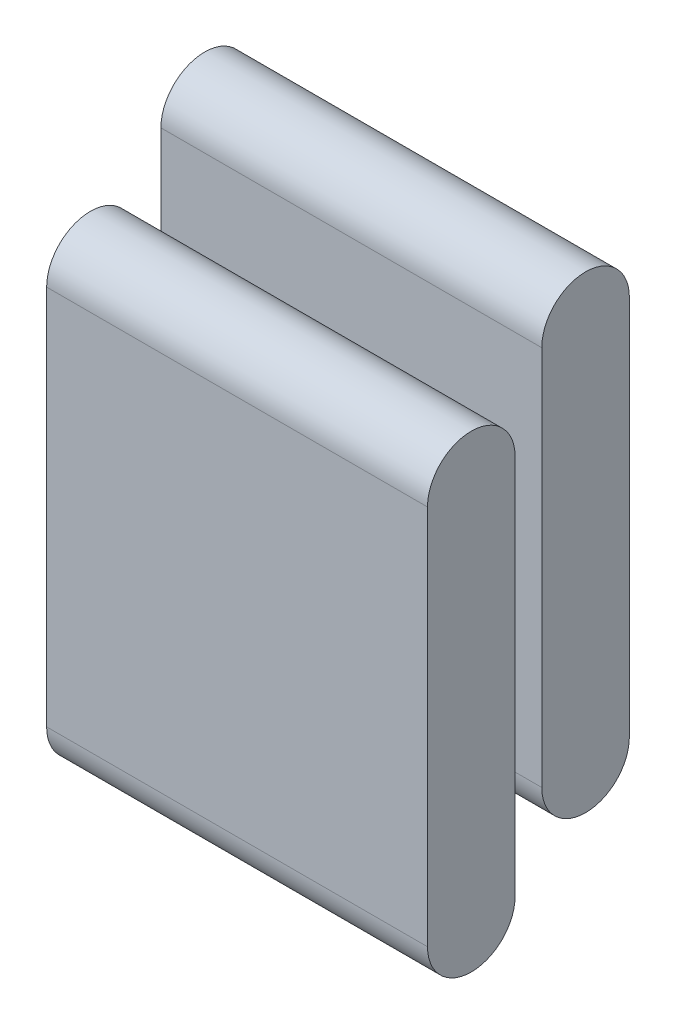
ISO-10303-21;
HEADER;
FILE_DESCRIPTION(('STEP AP214'),'2;1');
FILE_NAME('part.step','',(''),(''),'','','');
FILE_SCHEMA(('AUTOMOTIVE_DESIGN { 1 0 10303 214 1 1 1 1 }'));
ENDSEC;
DATA;
#1=APPLICATION_CONTEXT('core data for automotive mechanical design processes');
#2=APPLICATION_PROTOCOL_DEFINITION('international standard','automotive_design',2000,#1);
#3=PRODUCT_CONTEXT('',#1,'mechanical');
#4=PRODUCT('Part','Part','',(#3));
#5=PRODUCT_RELATED_PRODUCT_CATEGORY('part','',(#4));
#6=PRODUCT_DEFINITION_FORMATION('','',#4);
#7=PRODUCT_DEFINITION_CONTEXT('part definition',#1,'design');
#8=PRODUCT_DEFINITION('design','',#6,#7);
#9=PRODUCT_DEFINITION_SHAPE('','',#8);
#10=(LENGTH_UNIT() NAMED_UNIT(*) SI_UNIT(.MILLI.,.METRE.));
#11=(NAMED_UNIT(*) PLANE_ANGLE_UNIT() SI_UNIT($,.RADIAN.));
#12=(NAMED_UNIT(*) SI_UNIT($,.STERADIAN.) SOLID_ANGLE_UNIT());
#13=UNCERTAINTY_MEASURE_WITH_UNIT(LENGTH_MEASURE(1.E-05),#10,'distance_accuracy_value','');
#14=(GEOMETRIC_REPRESENTATION_CONTEXT(3) GLOBAL_UNCERTAINTY_ASSIGNED_CONTEXT((#13)) GLOBAL_UNIT_ASSIGNED_CONTEXT((#10,
#11,#12)) REPRESENTATION_CONTEXT('',''));
#15=CARTESIAN_POINT('',(0.,0.,0.));
#16=DIRECTION('',(0.,0.,1.));
#17=DIRECTION('',(1.,0.,0.));
#18=AXIS2_PLACEMENT_3D('',#15,#16,#17);
#19=CARTESIAN_POINT('',(10.,14.6986841535707,13.));
#20=DIRECTION('',(-1.,0.,0.));
#21=DIRECTION('',(0.,0.,1.));
#22=AXIS2_PLACEMENT_3D('',#19,#20,#21);
#23=CYLINDRICAL_SURFACE('',#22,1.15);
#24=CARTESIAN_POINT('',(0.,14.6986841535707,13.));
#25=DIRECTION('',(1.,0.,0.));
#26=DIRECTION('',(0.,0.,-1.));
#27=AXIS2_PLACEMENT_3D('',#24,#25,#26);
#28=CIRCLE('',#27,1.15);
#29=CARTESIAN_POINT('',(0.,14.6986841535707,11.85));
#30=VERTEX_POINT('',#29);
#31=CARTESIAN_POINT('',(0.,14.6986841535707,14.15));
#32=VERTEX_POINT('',#31);
#33=EDGE_CURVE('E12',#30,#32,#28,.T.);
#34=ORIENTED_EDGE('',*,*,#33,.T.);
#35=DIRECTION('',(-1.,0.,0.));
#36=VECTOR('',#35,1.);
#37=CARTESIAN_POINT('',(10.,14.6986841535707,14.15));
#38=LINE('',#37,#36);
#39=CARTESIAN_POINT('',(10.,14.6986841535707,14.15));
#40=VERTEX_POINT('',#39);
#41=EDGE_CURVE('E118',#40,#32,#38,.T.);
#42=ORIENTED_EDGE('',*,*,#41,.F.);
#43=CARTESIAN_POINT('',(10.,14.6986841535707,13.));
#44=DIRECTION('',(1.,0.,0.));
#45=DIRECTION('',(0.,0.,-1.));
#46=AXIS2_PLACEMENT_3D('',#43,#44,#45);
#47=CIRCLE('',#46,1.15);
#48=CARTESIAN_POINT('',(10.,14.6986841535707,11.85));
#49=VERTEX_POINT('',#48);
#50=EDGE_CURVE('E51',#49,#40,#47,.T.);
#51=ORIENTED_EDGE('',*,*,#50,.F.);
#52=DIRECTION('',(-1.,0.,0.));
#53=VECTOR('',#52,1.);
#54=CARTESIAN_POINT('',(10.,14.6986841535707,11.85));
#55=LINE('',#54,#53);
#56=EDGE_CURVE('E106',#49,#30,#55,.T.);
#57=ORIENTED_EDGE('',*,*,#56,.T.);
#58=EDGE_LOOP('',(#34,#42,#51,#57));
#59=FACE_BOUND('',#58,.T.);
#60=ADVANCED_FACE('F47',(#59),#23,.T.);
#61=CARTESIAN_POINT('',(10.,14.6986841535707,14.15));
#62=DIRECTION('',(0.,0.,-1.));
#63=DIRECTION('',(0.,1.,0.));
#64=AXIS2_PLACEMENT_3D('',#61,#62,#63);
#65=PLANE('',#64);
#66=DIRECTION('',(0.,-1.,0.));
#67=VECTOR('',#66,1.);
#68=CARTESIAN_POINT('',(0.,14.6986841535707,14.15));
#69=LINE('',#68,#67);
#70=CARTESIAN_POINT('',(0.,4.6986841535707,14.15));
#71=VERTEX_POINT('',#70);
#72=EDGE_CURVE('E57',#32,#71,#69,.T.);
#73=ORIENTED_EDGE('',*,*,#72,.T.);
#74=DIRECTION('',(-1.,0.,0.));
#75=VECTOR('',#74,1.);
#76=CARTESIAN_POINT('',(10.,4.6986841535707,14.15));
#77=LINE('',#76,#75);
#78=CARTESIAN_POINT('',(10.,4.6986841535707,14.15));
#79=VERTEX_POINT('',#78);
#80=EDGE_CURVE('E102',#79,#71,#77,.T.);
#81=ORIENTED_EDGE('',*,*,#80,.F.);
#82=DIRECTION('',(0.,-1.,0.));
#83=VECTOR('',#82,1.);
#84=CARTESIAN_POINT('',(10.,14.6986841535707,14.15));
#85=LINE('',#84,#83);
#86=EDGE_CURVE('E81',#40,#79,#85,.T.);
#87=ORIENTED_EDGE('',*,*,#86,.F.);
#88=ORIENTED_EDGE('',*,*,#41,.T.);
#89=EDGE_LOOP('',(#73,#81,#87,#88));
#90=FACE_BOUND('',#89,.T.);
#91=ADVANCED_FACE('F121',(#90),#65,.F.);
#92=CARTESIAN_POINT('',(10.,4.6986841535707,13.));
#93=DIRECTION('',(-1.,0.,0.));
#94=DIRECTION('',(0.,0.,1.));
#95=AXIS2_PLACEMENT_3D('',#92,#93,#94);
#96=CYLINDRICAL_SURFACE('',#95,1.15);
#97=CARTESIAN_POINT('',(0.,4.6986841535707,13.));
#98=DIRECTION('',(1.,0.,0.));
#99=DIRECTION('',(0.,0.,-1.));
#100=AXIS2_PLACEMENT_3D('',#97,#98,#99);
#101=CIRCLE('',#100,1.15);
#102=CARTESIAN_POINT('',(0.,4.6986841535707,11.85));
#103=VERTEX_POINT('',#102);
#104=EDGE_CURVE('E97',#71,#103,#101,.T.);
#105=ORIENTED_EDGE('',*,*,#104,.T.);
#106=DIRECTION('',(-1.,0.,0.));
#107=VECTOR('',#106,1.);
#108=CARTESIAN_POINT('',(10.,4.6986841535707,11.85));
#109=LINE('',#108,#107);
#110=CARTESIAN_POINT('',(10.,4.6986841535707,11.85));
#111=VERTEX_POINT('',#110);
#112=EDGE_CURVE('E100',#111,#103,#109,.T.);
#113=ORIENTED_EDGE('',*,*,#112,.F.);
#114=CARTESIAN_POINT('',(10.,4.6986841535707,13.));
#115=DIRECTION('',(1.,0.,0.));
#116=DIRECTION('',(0.,0.,-1.));
#117=AXIS2_PLACEMENT_3D('',#114,#115,#116);
#118=CIRCLE('',#117,1.15);
#119=EDGE_CURVE('E114',#79,#111,#118,.T.);
#120=ORIENTED_EDGE('',*,*,#119,.F.);
#121=ORIENTED_EDGE('',*,*,#80,.T.);
#122=EDGE_LOOP('',(#105,#113,#120,#121));
#123=FACE_BOUND('',#122,.T.);
#124=ADVANCED_FACE('F98',(#123),#96,.T.);
#125=CARTESIAN_POINT('',(10.,14.6986841535707,11.85));
#126=DIRECTION('',(0.,0.,1.));
#127=DIRECTION('',(0.,-1.,0.));
#128=AXIS2_PLACEMENT_3D('',#125,#126,#127);
#129=PLANE('',#128);
#130=DIRECTION('',(0.,1.,0.));
#131=VECTOR('',#130,1.);
#132=CARTESIAN_POINT('',(0.,14.6986841535707,11.85));
#133=LINE('',#132,#131);
#134=EDGE_CURVE('E91',#103,#30,#133,.T.);
#135=ORIENTED_EDGE('',*,*,#134,.T.);
#136=ORIENTED_EDGE('',*,*,#56,.F.);
#137=DIRECTION('',(0.,1.,0.));
#138=VECTOR('',#137,1.);
#139=CARTESIAN_POINT('',(10.,14.6986841535707,11.85));
#140=LINE('',#139,#138);
#141=EDGE_CURVE('E105',#111,#49,#140,.T.);
#142=ORIENTED_EDGE('',*,*,#141,.F.);
#143=ORIENTED_EDGE('',*,*,#112,.T.);
#144=EDGE_LOOP('',(#135,#136,#142,#143));
#145=FACE_BOUND('',#144,.T.);
#146=ADVANCED_FACE('F104',(#145),#129,.F.);
#147=CARTESIAN_POINT('',(10.,14.6986841535707,13.));
#148=DIRECTION('',(1.,0.,0.));
#149=DIRECTION('',(0.,0.,-1.));
#150=AXIS2_PLACEMENT_3D('',#147,#148,#149);
#151=PLANE('',#150);
#152=ORIENTED_EDGE('',*,*,#50,.T.);
#153=ORIENTED_EDGE('',*,*,#86,.T.);
#154=ORIENTED_EDGE('',*,*,#119,.T.);
#155=ORIENTED_EDGE('',*,*,#141,.T.);
#156=EDGE_LOOP('',(#152,#153,#154,#155));
#157=FACE_BOUND('',#156,.T.);
#158=ADVANCED_FACE('F49',(#157),#151,.T.);
#159=CARTESIAN_POINT('',(0.,14.6986841535707,13.));
#160=DIRECTION('',(1.,0.,0.));
#161=DIRECTION('',(0.,0.,-1.));
#162=AXIS2_PLACEMENT_3D('',#159,#160,#161);
#163=PLANE('',#162);
#164=ORIENTED_EDGE('',*,*,#33,.F.);
#165=ORIENTED_EDGE('',*,*,#134,.F.);
#166=ORIENTED_EDGE('',*,*,#104,.F.);
#167=ORIENTED_EDGE('',*,*,#72,.F.);
#168=EDGE_LOOP('',(#164,#165,#166,#167));
#169=FACE_BOUND('',#168,.T.);
#170=ADVANCED_FACE('F108',(#169),#163,.F.);
#171=CLOSED_SHELL('',(#60,#91,#124,#146,#158,#170));
#172=MANIFOLD_SOLID_BREP('B2',#171);
#173=CARTESIAN_POINT('',(10.,16.8205080756888,9.99999999999996));
#174=DIRECTION('',(-1.,0.,0.));
#175=DIRECTION('',(0.,0.,1.));
#176=AXIS2_PLACEMENT_3D('',#173,#174,#175);
#177=CYLINDRICAL_SURFACE('',#176,1.15);
#178=CARTESIAN_POINT('',(0.,16.8205080756888,9.99999999999996));
#179=DIRECTION('',(1.,0.,0.));
#180=DIRECTION('',(0.,0.,-1.));
#181=AXIS2_PLACEMENT_3D('',#178,#179,#180);
#182=CIRCLE('',#181,1.15);
#183=CARTESIAN_POINT('',(0.,16.8205080756888,8.84999999999996));
#184=VERTEX_POINT('',#183);
#185=CARTESIAN_POINT('',(0.,16.8205080756888,11.15));
#186=VERTEX_POINT('',#185);
#187=EDGE_CURVE('E246',#184,#186,#182,.T.);
#188=ORIENTED_EDGE('',*,*,#187,.T.);
#189=DIRECTION('',(-1.,0.,0.));
#190=VECTOR('',#189,1.);
#191=CARTESIAN_POINT('',(10.,16.8205080756888,11.15));
#192=LINE('',#191,#190);
#193=CARTESIAN_POINT('',(10.,16.8205080756888,11.15));
#194=VERTEX_POINT('',#193);
#195=EDGE_CURVE('E45',#194,#186,#192,.T.);
#196=ORIENTED_EDGE('',*,*,#195,.F.);
#197=CARTESIAN_POINT('',(10.,16.8205080756888,9.99999999999996));
#198=DIRECTION('',(1.,0.,0.));
#199=DIRECTION('',(0.,0.,-1.));
#200=AXIS2_PLACEMENT_3D('',#197,#198,#199);
#201=CIRCLE('',#200,1.15);
#202=CARTESIAN_POINT('',(10.,16.8205080756888,8.84999999999996));
#203=VERTEX_POINT('',#202);
#204=EDGE_CURVE('E234',#203,#194,#201,.T.);
#205=ORIENTED_EDGE('',*,*,#204,.F.);
#206=DIRECTION('',(-1.,0.,0.));
#207=VECTOR('',#206,1.);
#208=CARTESIAN_POINT('',(10.,16.8205080756888,8.84999999999996));
#209=LINE('',#208,#207);
#210=EDGE_CURVE('E242',#203,#184,#209,.T.);
#211=ORIENTED_EDGE('',*,*,#210,.T.);
#212=EDGE_LOOP('',(#188,#196,#205,#211));
#213=FACE_BOUND('',#212,.T.);
#214=ADVANCED_FACE('F183',(#213),#177,.T.);
#215=CARTESIAN_POINT('',(10.,16.8205080756888,11.15));
#216=DIRECTION('',(0.,0.,-1.));
#217=DIRECTION('',(-1.,0.,0.));
#218=AXIS2_PLACEMENT_3D('',#215,#216,#217);
#219=PLANE('',#218);
#220=DIRECTION('',(0.,-1.,0.));
#221=VECTOR('',#220,1.);
#222=CARTESIAN_POINT('',(0.,16.8205080756888,11.15));
#223=LINE('',#222,#221);
#224=CARTESIAN_POINT('',(0.,6.8205080756888,11.15));
#225=VERTEX_POINT('',#224);
#226=EDGE_CURVE('E238',#186,#225,#223,.T.);
#227=ORIENTED_EDGE('',*,*,#226,.T.);
#228=DIRECTION('',(-1.,0.,0.));
#229=VECTOR('',#228,1.);
#230=CARTESIAN_POINT('',(10.,6.8205080756888,11.15));
#231=LINE('',#230,#229);
#232=CARTESIAN_POINT('',(10.,6.8205080756888,11.15));
#233=VERTEX_POINT('',#232);
#234=EDGE_CURVE('E191',#233,#225,#231,.T.);
#235=ORIENTED_EDGE('',*,*,#234,.F.);
#236=DIRECTION('',(0.,-1.,0.));
#237=VECTOR('',#236,1.);
#238=CARTESIAN_POINT('',(10.,16.8205080756888,11.15));
#239=LINE('',#238,#237);
#240=EDGE_CURVE('E229',#194,#233,#239,.T.);
#241=ORIENTED_EDGE('',*,*,#240,.F.);
#242=ORIENTED_EDGE('',*,*,#195,.T.);
#243=EDGE_LOOP('',(#227,#235,#241,#242));
#244=FACE_BOUND('',#243,.T.);
#245=ADVANCED_FACE('F237',(#244),#219,.F.);
#246=CARTESIAN_POINT('',(10.,6.8205080756888,9.99999999999996));
#247=DIRECTION('',(-1.,0.,0.));
#248=DIRECTION('',(0.,0.,1.));
#249=AXIS2_PLACEMENT_3D('',#246,#247,#248);
#250=CYLINDRICAL_SURFACE('',#249,1.15);
#251=CARTESIAN_POINT('',(0.,6.8205080756888,9.99999999999996));
#252=DIRECTION('',(1.,0.,0.));
#253=DIRECTION('',(0.,0.,-1.));
#254=AXIS2_PLACEMENT_3D('',#251,#252,#253);
#255=CIRCLE('',#254,1.15);
#256=CARTESIAN_POINT('',(0.,6.8205080756888,8.84999999999996));
#257=VERTEX_POINT('',#256);
#258=EDGE_CURVE('E216',#225,#257,#255,.T.);
#259=ORIENTED_EDGE('',*,*,#258,.T.);
#260=DIRECTION('',(-1.,0.,0.));
#261=VECTOR('',#260,1.);
#262=CARTESIAN_POINT('',(10.,6.8205080756888,8.84999999999996));
#263=LINE('',#262,#261);
#264=CARTESIAN_POINT('',(10.,6.8205080756888,8.84999999999996));
#265=VERTEX_POINT('',#264);
#266=EDGE_CURVE('E239',#265,#257,#263,.T.);
#267=ORIENTED_EDGE('',*,*,#266,.F.);
#268=CARTESIAN_POINT('',(10.,6.8205080756888,9.99999999999996));
#269=DIRECTION('',(1.,0.,0.));
#270=DIRECTION('',(0.,0.,-1.));
#271=AXIS2_PLACEMENT_3D('',#268,#269,#270);
#272=CIRCLE('',#271,1.15);
#273=EDGE_CURVE('E232',#233,#265,#272,.T.);
#274=ORIENTED_EDGE('',*,*,#273,.F.);
#275=ORIENTED_EDGE('',*,*,#234,.T.);
#276=EDGE_LOOP('',(#259,#267,#274,#275));
#277=FACE_BOUND('',#276,.T.);
#278=ADVANCED_FACE('F240',(#277),#250,.T.);
#279=CARTESIAN_POINT('',(10.,16.8205080756888,8.84999999999996));
#280=DIRECTION('',(0.,0.,1.));
#281=DIRECTION('',(1.,0.,0.));
#282=AXIS2_PLACEMENT_3D('',#279,#280,#281);
#283=PLANE('',#282);
#284=DIRECTION('',(0.,1.,0.));
#285=VECTOR('',#284,1.);
#286=CARTESIAN_POINT('',(0.,16.8205080756888,8.84999999999996));
#287=LINE('',#286,#285);
#288=EDGE_CURVE('E222',#257,#184,#287,.T.);
#289=ORIENTED_EDGE('',*,*,#288,.T.);
#290=ORIENTED_EDGE('',*,*,#210,.F.);
#291=DIRECTION('',(0.,1.,0.));
#292=VECTOR('',#291,1.);
#293=CARTESIAN_POINT('',(10.,16.8205080756888,8.84999999999996));
#294=LINE('',#293,#292);
#295=EDGE_CURVE('E199',#265,#203,#294,.T.);
#296=ORIENTED_EDGE('',*,*,#295,.F.);
#297=ORIENTED_EDGE('',*,*,#266,.T.);
#298=EDGE_LOOP('',(#289,#290,#296,#297));
#299=FACE_BOUND('',#298,.T.);
#300=ADVANCED_FACE('F253',(#299),#283,.F.);
#301=CARTESIAN_POINT('',(10.,16.8205080756888,9.99999999999996));
#302=DIRECTION('',(1.,0.,0.));
#303=DIRECTION('',(0.,0.,-1.));
#304=AXIS2_PLACEMENT_3D('',#301,#302,#303);
#305=PLANE('',#304);
#306=ORIENTED_EDGE('',*,*,#204,.T.);
#307=ORIENTED_EDGE('',*,*,#240,.T.);
#308=ORIENTED_EDGE('',*,*,#273,.T.);
#309=ORIENTED_EDGE('',*,*,#295,.T.);
#310=EDGE_LOOP('',(#306,#307,#308,#309));
#311=FACE_BOUND('',#310,.T.);
#312=ADVANCED_FACE('F230',(#311),#305,.T.);
#313=CARTESIAN_POINT('',(0.,16.8205080756888,9.99999999999996));
#314=DIRECTION('',(1.,0.,0.));
#315=DIRECTION('',(0.,0.,-1.));
#316=AXIS2_PLACEMENT_3D('',#313,#314,#315);
#317=PLANE('',#316);
#318=ORIENTED_EDGE('',*,*,#187,.F.);
#319=ORIENTED_EDGE('',*,*,#288,.F.);
#320=ORIENTED_EDGE('',*,*,#258,.F.);
#321=ORIENTED_EDGE('',*,*,#226,.F.);
#322=EDGE_LOOP('',(#318,#319,#320,#321));
#323=FACE_BOUND('',#322,.T.);
#324=ADVANCED_FACE('F256',(#323),#317,.F.);
#325=CLOSED_SHELL('',(#214,#245,#278,#300,#312,#324));
#326=MANIFOLD_SOLID_BREP('B6',#325);
#327=ADVANCED_BREP_SHAPE_REPRESENTATION('',(#18,#172,#326),#14);
#328=SHAPE_DEFINITION_REPRESENTATION(#9,#327);
ENDSEC;
END-ISO-10303-21;
